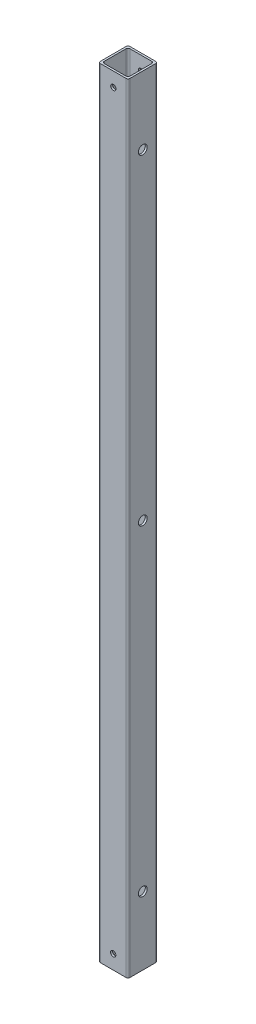
ISO-10303-21;
HEADER;
FILE_DESCRIPTION(('STEP AP214'),'2;1');
FILE_NAME('part.step','',(''),(''),'','','');
FILE_SCHEMA(('AUTOMOTIVE_DESIGN { 1 0 10303 214 1 1 1 1 }'));
ENDSEC;
DATA;
#1=APPLICATION_CONTEXT('core data for automotive mechanical design processes');
#2=APPLICATION_PROTOCOL_DEFINITION('international standard','automotive_design',2000,#1);
#3=PRODUCT_CONTEXT('',#1,'mechanical');
#4=PRODUCT('Part','Part','',(#3));
#5=PRODUCT_RELATED_PRODUCT_CATEGORY('part','',(#4));
#6=PRODUCT_DEFINITION_FORMATION('','',#4);
#7=PRODUCT_DEFINITION_CONTEXT('part definition',#1,'design');
#8=PRODUCT_DEFINITION('design','',#6,#7);
#9=PRODUCT_DEFINITION_SHAPE('','',#8);
#10=(LENGTH_UNIT() NAMED_UNIT(*) SI_UNIT(.MILLI.,.METRE.));
#11=(NAMED_UNIT(*) PLANE_ANGLE_UNIT() SI_UNIT($,.RADIAN.));
#12=(NAMED_UNIT(*) SI_UNIT($,.STERADIAN.) SOLID_ANGLE_UNIT());
#13=UNCERTAINTY_MEASURE_WITH_UNIT(LENGTH_MEASURE(1.E-05),#10,'distance_accuracy_value','');
#14=(GEOMETRIC_REPRESENTATION_CONTEXT(3) GLOBAL_UNCERTAINTY_ASSIGNED_CONTEXT((#13)) GLOBAL_UNIT_ASSIGNED_CONTEXT((#10,
#11,#12)) REPRESENTATION_CONTEXT('',''));
#15=CARTESIAN_POINT('',(0.,0.,0.));
#16=DIRECTION('',(0.,0.,1.));
#17=DIRECTION('',(1.,0.,0.));
#18=AXIS2_PLACEMENT_3D('',#15,#16,#17);
#19=CARTESIAN_POINT('',(0.,508.,0.));
#20=DIRECTION('',(0.,-1.,0.));
#21=DIRECTION('',(0.,0.,-1.));
#22=AXIS2_PLACEMENT_3D('',#19,#20,#21);
#23=PLANE('',#22);
#24=DIRECTION('',(0.,0.,1.));
#25=VECTOR('',#24,1.);
#26=CARTESIAN_POINT('',(-9.652,508.,9.652));
#27=LINE('',#26,#25);
#28=CARTESIAN_POINT('',(-9.652,508.,-8.382));
#29=VERTEX_POINT('',#28);
#30=CARTESIAN_POINT('',(-9.652,508.,8.382));
#31=VERTEX_POINT('',#30);
#32=EDGE_CURVE('E181',#29,#31,#27,.T.);
#33=ORIENTED_EDGE('',*,*,#32,.T.);
#34=CARTESIAN_POINT('',(-8.382,508.,8.382));
#35=DIRECTION('',(0.,-1.,0.));
#36=DIRECTION('',(0.,0.,-1.));
#37=AXIS2_PLACEMENT_3D('',#34,#35,#36);
#38=CIRCLE('',#37,1.27);
#39=CARTESIAN_POINT('',(-8.382,508.,9.652));
#40=VERTEX_POINT('',#39);
#41=EDGE_CURVE('E223',#31,#40,#38,.F.);
#42=ORIENTED_EDGE('',*,*,#41,.T.);
#43=DIRECTION('',(1.,0.,0.));
#44=VECTOR('',#43,1.);
#45=CARTESIAN_POINT('',(-9.652,508.,9.652));
#46=LINE('',#45,#44);
#47=CARTESIAN_POINT('',(8.382,508.,9.652));
#48=VERTEX_POINT('',#47);
#49=EDGE_CURVE('E176',#40,#48,#46,.T.);
#50=ORIENTED_EDGE('',*,*,#49,.T.);
#51=CARTESIAN_POINT('',(8.382,508.,8.382));
#52=DIRECTION('',(0.,-1.,0.));
#53=DIRECTION('',(0.,0.,-1.));
#54=AXIS2_PLACEMENT_3D('',#51,#52,#53);
#55=CIRCLE('',#54,1.27);
#56=CARTESIAN_POINT('',(9.652,508.,8.382));
#57=VERTEX_POINT('',#56);
#58=EDGE_CURVE('E218',#48,#57,#55,.F.);
#59=ORIENTED_EDGE('',*,*,#58,.T.);
#60=DIRECTION('',(0.,0.,-1.));
#61=VECTOR('',#60,1.);
#62=CARTESIAN_POINT('',(9.652,508.,9.652));
#63=LINE('',#62,#61);
#64=CARTESIAN_POINT('',(9.652,508.,-8.382));
#65=VERTEX_POINT('',#64);
#66=EDGE_CURVE('E302',#57,#65,#63,.T.);
#67=ORIENTED_EDGE('',*,*,#66,.T.);
#68=CARTESIAN_POINT('',(8.382,508.,-8.382));
#69=DIRECTION('',(0.,-1.,0.));
#70=DIRECTION('',(0.,0.,-1.));
#71=AXIS2_PLACEMENT_3D('',#68,#69,#70);
#72=CIRCLE('',#71,1.27);
#73=CARTESIAN_POINT('',(8.382,508.,-9.652));
#74=VERTEX_POINT('',#73);
#75=EDGE_CURVE('E59',#65,#74,#72,.F.);
#76=ORIENTED_EDGE('',*,*,#75,.T.);
#77=DIRECTION('',(-1.,0.,0.));
#78=VECTOR('',#77,1.);
#79=CARTESIAN_POINT('',(-9.652,508.,-9.652));
#80=LINE('',#79,#78);
#81=CARTESIAN_POINT('',(-8.382,508.,-9.652));
#82=VERTEX_POINT('',#81);
#83=EDGE_CURVE('E304',#74,#82,#80,.T.);
#84=ORIENTED_EDGE('',*,*,#83,.T.);
#85=CARTESIAN_POINT('',(-8.382,508.,-8.382));
#86=DIRECTION('',(0.,-1.,0.));
#87=DIRECTION('',(0.,0.,-1.));
#88=AXIS2_PLACEMENT_3D('',#85,#86,#87);
#89=CIRCLE('',#88,1.27);
#90=EDGE_CURVE('E221',#82,#29,#89,.F.);
#91=ORIENTED_EDGE('',*,*,#90,.T.);
#92=EDGE_LOOP('',(#33,#42,#50,#59,#67,#76,#84,#91));
#93=FACE_BOUND('',#92,.T.);
#94=DIRECTION('',(1.,0.,0.));
#95=VECTOR('',#94,1.);
#96=CARTESIAN_POINT('',(-8.382,508.,8.382));
#97=LINE('',#96,#95);
#98=CARTESIAN_POINT('',(-7.112,508.,8.382));
#99=VERTEX_POINT('',#98);
#100=CARTESIAN_POINT('',(7.112,508.,8.382));
#101=VERTEX_POINT('',#100);
#102=EDGE_CURVE('E285',#99,#101,#97,.T.);
#103=ORIENTED_EDGE('',*,*,#102,.F.);
#104=CARTESIAN_POINT('',(-7.112,508.,7.112));
#105=DIRECTION('',(0.,-1.,0.));
#106=DIRECTION('',(0.,0.,-1.));
#107=AXIS2_PLACEMENT_3D('',#104,#105,#106);
#108=CIRCLE('',#107,1.27);
#109=CARTESIAN_POINT('',(-8.382,508.,7.112));
#110=VERTEX_POINT('',#109);
#111=EDGE_CURVE('E11',#99,#110,#108,.T.);
#112=ORIENTED_EDGE('',*,*,#111,.T.);
#113=DIRECTION('',(0.,0.,1.));
#114=VECTOR('',#113,1.);
#115=CARTESIAN_POINT('',(-8.382,508.,8.382));
#116=LINE('',#115,#114);
#117=CARTESIAN_POINT('',(-8.382,508.,-7.11199999999999));
#118=VERTEX_POINT('',#117);
#119=EDGE_CURVE('E293',#118,#110,#116,.T.);
#120=ORIENTED_EDGE('',*,*,#119,.F.);
#121=CARTESIAN_POINT('',(-7.112,508.,-7.112));
#122=DIRECTION('',(0.,-1.,0.));
#123=DIRECTION('',(0.,0.,-1.));
#124=AXIS2_PLACEMENT_3D('',#121,#122,#123);
#125=CIRCLE('',#124,1.27);
#126=CARTESIAN_POINT('',(-7.112,508.,-8.382));
#127=VERTEX_POINT('',#126);
#128=EDGE_CURVE('E236',#118,#127,#125,.T.);
#129=ORIENTED_EDGE('',*,*,#128,.T.);
#130=DIRECTION('',(-1.,0.,0.));
#131=VECTOR('',#130,1.);
#132=CARTESIAN_POINT('',(-8.382,508.,-8.382));
#133=LINE('',#132,#131);
#134=CARTESIAN_POINT('',(7.112,508.,-8.382));
#135=VERTEX_POINT('',#134);
#136=EDGE_CURVE('E291',#135,#127,#133,.T.);
#137=ORIENTED_EDGE('',*,*,#136,.F.);
#138=CARTESIAN_POINT('',(7.112,508.,-7.112));
#139=DIRECTION('',(0.,-1.,0.));
#140=DIRECTION('',(0.,0.,-1.));
#141=AXIS2_PLACEMENT_3D('',#138,#139,#140);
#142=CIRCLE('',#141,1.27);
#143=CARTESIAN_POINT('',(8.382,508.,-7.11199999999999));
#144=VERTEX_POINT('',#143);
#145=EDGE_CURVE('E161',#135,#144,#142,.T.);
#146=ORIENTED_EDGE('',*,*,#145,.T.);
#147=DIRECTION('',(0.,0.,-1.));
#148=VECTOR('',#147,1.);
#149=CARTESIAN_POINT('',(8.382,508.,8.382));
#150=LINE('',#149,#148);
#151=CARTESIAN_POINT('',(8.382,508.,7.112));
#152=VERTEX_POINT('',#151);
#153=EDGE_CURVE('E288',#152,#144,#150,.T.);
#154=ORIENTED_EDGE('',*,*,#153,.F.);
#155=CARTESIAN_POINT('',(7.112,508.,7.112));
#156=DIRECTION('',(0.,-1.,0.));
#157=DIRECTION('',(0.,0.,-1.));
#158=AXIS2_PLACEMENT_3D('',#155,#156,#157);
#159=CIRCLE('',#158,1.27);
#160=EDGE_CURVE('E162',#152,#101,#159,.T.);
#161=ORIENTED_EDGE('',*,*,#160,.T.);
#162=EDGE_LOOP('',(#103,#112,#120,#129,#137,#146,#154,#161));
#163=FACE_BOUND('',#162,.T.);
#164=ADVANCED_FACE('F35',(#93,#163),#23,.F.);
#165=CARTESIAN_POINT('',(0.,0.,0.));
#166=DIRECTION('',(0.,-1.,0.));
#167=DIRECTION('',(0.,0.,-1.));
#168=AXIS2_PLACEMENT_3D('',#165,#166,#167);
#169=PLANE('',#168);
#170=DIRECTION('',(1.,0.,0.));
#171=VECTOR('',#170,1.);
#172=CARTESIAN_POINT('',(-9.652,0.,9.652));
#173=LINE('',#172,#171);
#174=CARTESIAN_POINT('',(-8.382,0.,9.652));
#175=VERTEX_POINT('',#174);
#176=CARTESIAN_POINT('',(8.382,0.,9.652));
#177=VERTEX_POINT('',#176);
#178=EDGE_CURVE('E184',#175,#177,#173,.T.);
#179=ORIENTED_EDGE('',*,*,#178,.F.);
#180=CARTESIAN_POINT('',(-8.382,0.,8.382));
#181=DIRECTION('',(0.,-1.,0.));
#182=DIRECTION('',(0.,0.,-1.));
#183=AXIS2_PLACEMENT_3D('',#180,#181,#182);
#184=CIRCLE('',#183,1.27);
#185=CARTESIAN_POINT('',(-9.652,0.,8.382));
#186=VERTEX_POINT('',#185);
#187=EDGE_CURVE('E211',#175,#186,#184,.T.);
#188=ORIENTED_EDGE('',*,*,#187,.T.);
#189=DIRECTION('',(0.,0.,1.));
#190=VECTOR('',#189,1.);
#191=CARTESIAN_POINT('',(-9.652,0.,9.652));
#192=LINE('',#191,#190);
#193=CARTESIAN_POINT('',(-9.652,0.,-8.382));
#194=VERTEX_POINT('',#193);
#195=EDGE_CURVE('E311',#194,#186,#192,.T.);
#196=ORIENTED_EDGE('',*,*,#195,.F.);
#197=CARTESIAN_POINT('',(-8.382,0.,-8.382));
#198=DIRECTION('',(0.,-1.,0.));
#199=DIRECTION('',(0.,0.,-1.));
#200=AXIS2_PLACEMENT_3D('',#197,#198,#199);
#201=CIRCLE('',#200,1.27);
#202=CARTESIAN_POINT('',(-8.382,0.,-9.652));
#203=VERTEX_POINT('',#202);
#204=EDGE_CURVE('E209',#194,#203,#201,.T.);
#205=ORIENTED_EDGE('',*,*,#204,.T.);
#206=DIRECTION('',(-1.,0.,0.));
#207=VECTOR('',#206,1.);
#208=CARTESIAN_POINT('',(-9.652,0.,-9.652));
#209=LINE('',#208,#207);
#210=CARTESIAN_POINT('',(8.382,0.,-9.652));
#211=VERTEX_POINT('',#210);
#212=EDGE_CURVE('E310',#211,#203,#209,.T.);
#213=ORIENTED_EDGE('',*,*,#212,.F.);
#214=CARTESIAN_POINT('',(8.382,0.,-8.382));
#215=DIRECTION('',(0.,-1.,0.));
#216=DIRECTION('',(0.,0.,-1.));
#217=AXIS2_PLACEMENT_3D('',#214,#215,#216);
#218=CIRCLE('',#217,1.27);
#219=CARTESIAN_POINT('',(9.652,0.,-8.382));
#220=VERTEX_POINT('',#219);
#221=EDGE_CURVE('E207',#211,#220,#218,.T.);
#222=ORIENTED_EDGE('',*,*,#221,.T.);
#223=DIRECTION('',(0.,0.,-1.));
#224=VECTOR('',#223,1.);
#225=CARTESIAN_POINT('',(9.652,0.,9.652));
#226=LINE('',#225,#224);
#227=CARTESIAN_POINT('',(9.652,0.,8.382));
#228=VERTEX_POINT('',#227);
#229=EDGE_CURVE('E296',#228,#220,#226,.T.);
#230=ORIENTED_EDGE('',*,*,#229,.F.);
#231=CARTESIAN_POINT('',(8.382,0.,8.382));
#232=DIRECTION('',(0.,-1.,0.));
#233=DIRECTION('',(0.,0.,-1.));
#234=AXIS2_PLACEMENT_3D('',#231,#232,#233);
#235=CIRCLE('',#234,1.27);
#236=EDGE_CURVE('E205',#228,#177,#235,.T.);
#237=ORIENTED_EDGE('',*,*,#236,.T.);
#238=EDGE_LOOP('',(#179,#188,#196,#205,#213,#222,#230,#237));
#239=FACE_BOUND('',#238,.T.);
#240=DIRECTION('',(-1.,0.,0.));
#241=VECTOR('',#240,1.);
#242=CARTESIAN_POINT('',(-8.382,0.,-8.382));
#243=LINE('',#242,#241);
#244=CARTESIAN_POINT('',(7.112,0.,-8.382));
#245=VERTEX_POINT('',#244);
#246=CARTESIAN_POINT('',(-7.112,0.,-8.382));
#247=VERTEX_POINT('',#246);
#248=EDGE_CURVE('E154',#245,#247,#243,.T.);
#249=ORIENTED_EDGE('',*,*,#248,.T.);
#250=CARTESIAN_POINT('',(-7.112,0.,-7.112));
#251=DIRECTION('',(0.,-1.,0.));
#252=DIRECTION('',(0.,0.,-1.));
#253=AXIS2_PLACEMENT_3D('',#250,#251,#252);
#254=CIRCLE('',#253,1.27);
#255=CARTESIAN_POINT('',(-8.382,0.,-7.11199999999999));
#256=VERTEX_POINT('',#255);
#257=EDGE_CURVE('E234',#247,#256,#254,.F.);
#258=ORIENTED_EDGE('',*,*,#257,.T.);
#259=DIRECTION('',(0.,0.,1.));
#260=VECTOR('',#259,1.);
#261=CARTESIAN_POINT('',(-8.382,0.,8.382));
#262=LINE('',#261,#260);
#263=CARTESIAN_POINT('',(-8.382,0.,7.112));
#264=VERTEX_POINT('',#263);
#265=EDGE_CURVE('E172',#256,#264,#262,.T.);
#266=ORIENTED_EDGE('',*,*,#265,.T.);
#267=CARTESIAN_POINT('',(-7.112,0.,7.112));
#268=DIRECTION('',(0.,-1.,0.));
#269=DIRECTION('',(0.,0.,-1.));
#270=AXIS2_PLACEMENT_3D('',#267,#268,#269);
#271=CIRCLE('',#270,1.27);
#272=CARTESIAN_POINT('',(-7.112,0.,8.382));
#273=VERTEX_POINT('',#272);
#274=EDGE_CURVE('E44',#264,#273,#271,.F.);
#275=ORIENTED_EDGE('',*,*,#274,.T.);
#276=DIRECTION('',(1.,0.,0.));
#277=VECTOR('',#276,1.);
#278=CARTESIAN_POINT('',(-8.382,0.,8.382));
#279=LINE('',#278,#277);
#280=CARTESIAN_POINT('',(7.112,0.,8.382));
#281=VERTEX_POINT('',#280);
#282=EDGE_CURVE('E284',#273,#281,#279,.T.);
#283=ORIENTED_EDGE('',*,*,#282,.T.);
#284=CARTESIAN_POINT('',(7.112,0.,7.112));
#285=DIRECTION('',(0.,-1.,0.));
#286=DIRECTION('',(0.,0.,-1.));
#287=AXIS2_PLACEMENT_3D('',#284,#285,#286);
#288=CIRCLE('',#287,1.27);
#289=CARTESIAN_POINT('',(8.382,0.,7.112));
#290=VERTEX_POINT('',#289);
#291=EDGE_CURVE('E238',#281,#290,#288,.F.);
#292=ORIENTED_EDGE('',*,*,#291,.T.);
#293=DIRECTION('',(0.,0.,-1.));
#294=VECTOR('',#293,1.);
#295=CARTESIAN_POINT('',(8.382,0.,8.382));
#296=LINE('',#295,#294);
#297=CARTESIAN_POINT('',(8.382,0.,-7.11199999999999));
#298=VERTEX_POINT('',#297);
#299=EDGE_CURVE('E156',#290,#298,#296,.T.);
#300=ORIENTED_EDGE('',*,*,#299,.T.);
#301=CARTESIAN_POINT('',(7.112,0.,-7.112));
#302=DIRECTION('',(0.,-1.,0.));
#303=DIRECTION('',(0.,0.,-1.));
#304=AXIS2_PLACEMENT_3D('',#301,#302,#303);
#305=CIRCLE('',#304,1.27);
#306=EDGE_CURVE('E151',#298,#245,#305,.F.);
#307=ORIENTED_EDGE('',*,*,#306,.T.);
#308=EDGE_LOOP('',(#249,#258,#266,#275,#283,#292,#300,#307));
#309=FACE_BOUND('',#308,.T.);
#310=ADVANCED_FACE('F153',(#239,#309),#169,.T.);
#311=CARTESIAN_POINT('',(9.652,508.,9.652));
#312=DIRECTION('',(-1.,0.,0.));
#313=DIRECTION('',(0.,0.,1.));
#314=AXIS2_PLACEMENT_3D('',#311,#312,#313);
#315=PLANE('',#314);
#316=CARTESIAN_POINT('',(9.652,44.45,0.));
#317=DIRECTION('',(-1.,0.,0.));
#318=DIRECTION('',(0.,0.,1.));
#319=AXIS2_PLACEMENT_3D('',#316,#317,#318);
#320=CIRCLE('',#319,2.8956);
#321=CARTESIAN_POINT('',(9.652,44.45,2.8956));
#322=VERTEX_POINT('',#321);
#323=EDGE_CURVE('E255',#322,#322,#320,.T.);
#324=ORIENTED_EDGE('',*,*,#323,.T.);
#325=EDGE_LOOP('',(#324));
#326=FACE_BOUND('',#325,.T.);
#327=CARTESIAN_POINT('',(9.652,254.,0.));
#328=DIRECTION('',(-1.,0.,0.));
#329=DIRECTION('',(0.,0.,1.));
#330=AXIS2_PLACEMENT_3D('',#327,#328,#329);
#331=CIRCLE('',#330,2.8956);
#332=CARTESIAN_POINT('',(9.652,254.,2.8956));
#333=VERTEX_POINT('',#332);
#334=EDGE_CURVE('E251',#333,#333,#331,.T.);
#335=ORIENTED_EDGE('',*,*,#334,.T.);
#336=EDGE_LOOP('',(#335));
#337=FACE_BOUND('',#336,.T.);
#338=CARTESIAN_POINT('',(9.652,463.55,0.));
#339=DIRECTION('',(-1.,0.,0.));
#340=DIRECTION('',(0.,0.,1.));
#341=AXIS2_PLACEMENT_3D('',#338,#339,#340);
#342=CIRCLE('',#341,2.8956);
#343=CARTESIAN_POINT('',(9.652,463.55,2.8956));
#344=VERTEX_POINT('',#343);
#345=EDGE_CURVE('E247',#344,#344,#342,.T.);
#346=ORIENTED_EDGE('',*,*,#345,.T.);
#347=EDGE_LOOP('',(#346));
#348=FACE_BOUND('',#347,.T.);
#349=ORIENTED_EDGE('',*,*,#229,.T.);
#350=DIRECTION('',(0.,-1.,0.));
#351=VECTOR('',#350,1.);
#352=CARTESIAN_POINT('',(9.652,508.,-8.382));
#353=LINE('',#352,#351);
#354=EDGE_CURVE('E232',#220,#65,#353,.F.);
#355=ORIENTED_EDGE('',*,*,#354,.T.);
#356=ORIENTED_EDGE('',*,*,#66,.F.);
#357=DIRECTION('',(0.,-1.,0.));
#358=VECTOR('',#357,1.);
#359=CARTESIAN_POINT('',(9.652,508.,8.382));
#360=LINE('',#359,#358);
#361=EDGE_CURVE('E229',#57,#228,#360,.T.);
#362=ORIENTED_EDGE('',*,*,#361,.T.);
#363=EDGE_LOOP('',(#349,#355,#356,#362));
#364=FACE_BOUND('',#363,.T.);
#365=ADVANCED_FACE('F330',(#326,#337,#348,#364),#315,.F.);
#366=CARTESIAN_POINT('',(-9.652,508.,-9.652));
#367=DIRECTION('',(0.,0.,1.));
#368=DIRECTION('',(1.,0.,0.));
#369=AXIS2_PLACEMENT_3D('',#366,#367,#368);
#370=PLANE('',#369);
#371=CARTESIAN_POINT('',(0.,9.271,-9.652));
#372=DIRECTION('',(0.,0.,1.));
#373=DIRECTION('',(1.,0.,0.));
#374=AXIS2_PLACEMENT_3D('',#371,#372,#373);
#375=CIRCLE('',#374,1.7272);
#376=CARTESIAN_POINT('',(1.72720000000006,9.271,-9.652));
#377=VERTEX_POINT('',#376);
#378=EDGE_CURVE('E673',#377,#377,#375,.T.);
#379=ORIENTED_EDGE('',*,*,#378,.T.);
#380=EDGE_LOOP('',(#379));
#381=FACE_BOUND('',#380,.T.);
#382=CARTESIAN_POINT('',(0.103095801553498,498.728999999999,-9.652));
#383=DIRECTION('',(0.,0.,1.));
#384=DIRECTION('',(1.,0.,0.));
#385=AXIS2_PLACEMENT_3D('',#382,#383,#384);
#386=CIRCLE('',#385,1.7272);
#387=CARTESIAN_POINT('',(1.83029580155349,498.728999999999,-9.652));
#388=VERTEX_POINT('',#387);
#389=EDGE_CURVE('E660',#388,#388,#386,.T.);
#390=ORIENTED_EDGE('',*,*,#389,.T.);
#391=EDGE_LOOP('',(#390));
#392=FACE_BOUND('',#391,.T.);
#393=ORIENTED_EDGE('',*,*,#212,.T.);
#394=DIRECTION('',(0.,-1.,0.));
#395=VECTOR('',#394,1.);
#396=CARTESIAN_POINT('',(-8.382,508.,-9.652));
#397=LINE('',#396,#395);
#398=EDGE_CURVE('E52',#203,#82,#397,.F.);
#399=ORIENTED_EDGE('',*,*,#398,.T.);
#400=ORIENTED_EDGE('',*,*,#83,.F.);
#401=DIRECTION('',(0.,-1.,0.));
#402=VECTOR('',#401,1.);
#403=CARTESIAN_POINT('',(8.382,508.,-9.652));
#404=LINE('',#403,#402);
#405=EDGE_CURVE('E225',#74,#211,#404,.T.);
#406=ORIENTED_EDGE('',*,*,#405,.T.);
#407=EDGE_LOOP('',(#393,#399,#400,#406));
#408=FACE_BOUND('',#407,.T.);
#409=ADVANCED_FACE('F337',(#381,#392,#408),#370,.F.);
#410=CARTESIAN_POINT('',(-9.652,508.,9.652));
#411=DIRECTION('',(1.,0.,0.));
#412=DIRECTION('',(0.,0.,-1.));
#413=AXIS2_PLACEMENT_3D('',#410,#411,#412);
#414=PLANE('',#413);
#415=CARTESIAN_POINT('',(-9.652,44.45,0.));
#416=DIRECTION('',(-1.,0.,0.));
#417=DIRECTION('',(0.,0.,1.));
#418=AXIS2_PLACEMENT_3D('',#415,#416,#417);
#419=CIRCLE('',#418,2.89559999999998);
#420=CARTESIAN_POINT('',(-9.652,44.45,2.89559999999998));
#421=VERTEX_POINT('',#420);
#422=EDGE_CURVE('E262',#421,#421,#419,.T.);
#423=ORIENTED_EDGE('',*,*,#422,.F.);
#424=EDGE_LOOP('',(#423));
#425=FACE_BOUND('',#424,.T.);
#426=CARTESIAN_POINT('',(-9.652,254.,0.));
#427=DIRECTION('',(-1.,0.,0.));
#428=DIRECTION('',(0.,0.,1.));
#429=AXIS2_PLACEMENT_3D('',#426,#427,#428);
#430=CIRCLE('',#429,2.8956);
#431=CARTESIAN_POINT('',(-9.652,254.,2.8956));
#432=VERTEX_POINT('',#431);
#433=EDGE_CURVE('E259',#432,#432,#430,.T.);
#434=ORIENTED_EDGE('',*,*,#433,.F.);
#435=EDGE_LOOP('',(#434));
#436=FACE_BOUND('',#435,.T.);
#437=CARTESIAN_POINT('',(-9.652,463.55,0.));
#438=DIRECTION('',(-1.,0.,0.));
#439=DIRECTION('',(0.,0.,1.));
#440=AXIS2_PLACEMENT_3D('',#437,#438,#439);
#441=CIRCLE('',#440,2.8956);
#442=CARTESIAN_POINT('',(-9.652,463.55,2.8956));
#443=VERTEX_POINT('',#442);
#444=EDGE_CURVE('E277',#443,#443,#441,.T.);
#445=ORIENTED_EDGE('',*,*,#444,.F.);
#446=EDGE_LOOP('',(#445));
#447=FACE_BOUND('',#446,.T.);
#448=ORIENTED_EDGE('',*,*,#195,.T.);
#449=DIRECTION('',(0.,-1.,0.));
#450=VECTOR('',#449,1.);
#451=CARTESIAN_POINT('',(-9.652,508.,8.382));
#452=LINE('',#451,#450);
#453=EDGE_CURVE('E216',#186,#31,#452,.F.);
#454=ORIENTED_EDGE('',*,*,#453,.T.);
#455=ORIENTED_EDGE('',*,*,#32,.F.);
#456=DIRECTION('',(0.,-1.,0.));
#457=VECTOR('',#456,1.);
#458=CARTESIAN_POINT('',(-9.652,508.,-8.382));
#459=LINE('',#458,#457);
#460=EDGE_CURVE('E213',#29,#194,#459,.T.);
#461=ORIENTED_EDGE('',*,*,#460,.T.);
#462=EDGE_LOOP('',(#448,#454,#455,#461));
#463=FACE_BOUND('',#462,.T.);
#464=ADVANCED_FACE('F343',(#425,#436,#447,#463),#414,.F.);
#465=CARTESIAN_POINT('',(-9.652,508.,9.652));
#466=DIRECTION('',(0.,0.,-1.));
#467=DIRECTION('',(-1.,0.,0.));
#468=AXIS2_PLACEMENT_3D('',#465,#466,#467);
#469=PLANE('',#468);
#470=CARTESIAN_POINT('',(0.,9.271,9.652));
#471=DIRECTION('',(0.,0.,1.));
#472=DIRECTION('',(1.,0.,0.));
#473=AXIS2_PLACEMENT_3D('',#470,#471,#472);
#474=CIRCLE('',#473,1.7272);
#475=CARTESIAN_POINT('',(1.72720000000006,9.271,9.652));
#476=VERTEX_POINT('',#475);
#477=EDGE_CURVE('E676',#476,#476,#474,.T.);
#478=ORIENTED_EDGE('',*,*,#477,.F.);
#479=EDGE_LOOP('',(#478));
#480=FACE_BOUND('',#479,.T.);
#481=CARTESIAN_POINT('',(0.103095801553498,498.728999999999,9.652));
#482=DIRECTION('',(0.,0.,1.));
#483=DIRECTION('',(1.,0.,0.));
#484=AXIS2_PLACEMENT_3D('',#481,#482,#483);
#485=CIRCLE('',#484,1.7272);
#486=CARTESIAN_POINT('',(1.8302958015535,498.728999999999,9.652));
#487=VERTEX_POINT('',#486);
#488=EDGE_CURVE('E663',#487,#487,#485,.T.);
#489=ORIENTED_EDGE('',*,*,#488,.F.);
#490=EDGE_LOOP('',(#489));
#491=FACE_BOUND('',#490,.T.);
#492=ORIENTED_EDGE('',*,*,#49,.F.);
#493=DIRECTION('',(0.,-1.,0.));
#494=VECTOR('',#493,1.);
#495=CARTESIAN_POINT('',(-8.382,508.,9.652));
#496=LINE('',#495,#494);
#497=EDGE_CURVE('E202',#40,#175,#496,.T.);
#498=ORIENTED_EDGE('',*,*,#497,.T.);
#499=ORIENTED_EDGE('',*,*,#178,.T.);
#500=DIRECTION('',(0.,-1.,0.));
#501=VECTOR('',#500,1.);
#502=CARTESIAN_POINT('',(8.382,508.,9.652));
#503=LINE('',#502,#501);
#504=EDGE_CURVE('E200',#177,#48,#503,.F.);
#505=ORIENTED_EDGE('',*,*,#504,.T.);
#506=EDGE_LOOP('',(#492,#498,#499,#505));
#507=FACE_BOUND('',#506,.T.);
#508=ADVANCED_FACE('F321',(#480,#491,#507),#469,.F.);
#509=CARTESIAN_POINT('',(-8.382,508.,8.382));
#510=DIRECTION('',(0.,0.,-1.));
#511=DIRECTION('',(-1.,0.,0.));
#512=AXIS2_PLACEMENT_3D('',#509,#510,#511);
#513=PLANE('',#512);
#514=CARTESIAN_POINT('',(0.,9.271,8.382));
#515=DIRECTION('',(0.,0.,-1.));
#516=DIRECTION('',(-1.,0.,0.));
#517=AXIS2_PLACEMENT_3D('',#514,#515,#516);
#518=CIRCLE('',#517,1.7272);
#519=CARTESIAN_POINT('',(-1.72719999999993,9.271,8.382));
#520=VERTEX_POINT('',#519);
#521=EDGE_CURVE('E39',#520,#520,#518,.T.);
#522=ORIENTED_EDGE('',*,*,#521,.F.);
#523=EDGE_LOOP('',(#522));
#524=FACE_BOUND('',#523,.T.);
#525=CARTESIAN_POINT('',(0.103095801553498,498.728999999999,8.382));
#526=DIRECTION('',(0.,0.,-1.));
#527=DIRECTION('',(-1.,0.,0.));
#528=AXIS2_PLACEMENT_3D('',#525,#526,#527);
#529=CIRCLE('',#528,1.7272);
#530=CARTESIAN_POINT('',(-1.6241041984465,498.728999999999,8.382));
#531=VERTEX_POINT('',#530);
#532=EDGE_CURVE('E662',#531,#531,#529,.T.);
#533=ORIENTED_EDGE('',*,*,#532,.F.);
#534=EDGE_LOOP('',(#533));
#535=FACE_BOUND('',#534,.T.);
#536=ORIENTED_EDGE('',*,*,#102,.T.);
#537=DIRECTION('',(0.,-1.,0.));
#538=VECTOR('',#537,1.);
#539=CARTESIAN_POINT('',(7.112,0.,8.382));
#540=LINE('',#539,#538);
#541=EDGE_CURVE('E193',#101,#281,#540,.T.);
#542=ORIENTED_EDGE('',*,*,#541,.T.);
#543=ORIENTED_EDGE('',*,*,#282,.F.);
#544=DIRECTION('',(0.,-1.,0.));
#545=VECTOR('',#544,1.);
#546=CARTESIAN_POINT('',(-7.112,508.,8.382));
#547=LINE('',#546,#545);
#548=EDGE_CURVE('E191',#273,#99,#547,.F.);
#549=ORIENTED_EDGE('',*,*,#548,.T.);
#550=EDGE_LOOP('',(#536,#542,#543,#549));
#551=FACE_BOUND('',#550,.T.);
#552=ADVANCED_FACE('F364',(#524,#535,#551),#513,.T.);
#553=CARTESIAN_POINT('',(8.382,508.,8.382));
#554=DIRECTION('',(-1.,0.,0.));
#555=DIRECTION('',(0.,0.,1.));
#556=AXIS2_PLACEMENT_3D('',#553,#554,#555);
#557=PLANE('',#556);
#558=CARTESIAN_POINT('',(8.382,44.45,0.));
#559=DIRECTION('',(-1.,0.,0.));
#560=DIRECTION('',(0.,0.,1.));
#561=AXIS2_PLACEMENT_3D('',#558,#559,#560);
#562=CIRCLE('',#561,2.89559999999999);
#563=CARTESIAN_POINT('',(8.382,44.45,2.89559999999999));
#564=VERTEX_POINT('',#563);
#565=EDGE_CURVE('E254',#564,#564,#562,.T.);
#566=ORIENTED_EDGE('',*,*,#565,.F.);
#567=EDGE_LOOP('',(#566));
#568=FACE_BOUND('',#567,.T.);
#569=CARTESIAN_POINT('',(8.382,254.,0.));
#570=DIRECTION('',(-1.,0.,0.));
#571=DIRECTION('',(0.,0.,1.));
#572=AXIS2_PLACEMENT_3D('',#569,#570,#571);
#573=CIRCLE('',#572,2.8956);
#574=CARTESIAN_POINT('',(8.382,254.,2.8956));
#575=VERTEX_POINT('',#574);
#576=EDGE_CURVE('E250',#575,#575,#573,.T.);
#577=ORIENTED_EDGE('',*,*,#576,.F.);
#578=EDGE_LOOP('',(#577));
#579=FACE_BOUND('',#578,.T.);
#580=CARTESIAN_POINT('',(8.382,463.55,0.));
#581=DIRECTION('',(-1.,0.,0.));
#582=DIRECTION('',(0.,0.,1.));
#583=AXIS2_PLACEMENT_3D('',#580,#581,#582);
#584=CIRCLE('',#583,2.8956);
#585=CARTESIAN_POINT('',(8.382,463.55,2.8956));
#586=VERTEX_POINT('',#585);
#587=EDGE_CURVE('E246',#586,#586,#584,.T.);
#588=ORIENTED_EDGE('',*,*,#587,.F.);
#589=EDGE_LOOP('',(#588));
#590=FACE_BOUND('',#589,.T.);
#591=ORIENTED_EDGE('',*,*,#299,.F.);
#592=DIRECTION('',(0.,-1.,0.));
#593=VECTOR('',#592,1.);
#594=CARTESIAN_POINT('',(8.382,508.,7.112));
#595=LINE('',#594,#593);
#596=EDGE_CURVE('E198',#290,#152,#595,.F.);
#597=ORIENTED_EDGE('',*,*,#596,.T.);
#598=ORIENTED_EDGE('',*,*,#153,.T.);
#599=DIRECTION('',(0.,-1.,0.));
#600=VECTOR('',#599,1.);
#601=CARTESIAN_POINT('',(8.382,0.,-7.112));
#602=LINE('',#601,#600);
#603=EDGE_CURVE('E196',#144,#298,#602,.T.);
#604=ORIENTED_EDGE('',*,*,#603,.T.);
#605=EDGE_LOOP('',(#591,#597,#598,#604));
#606=FACE_BOUND('',#605,.T.);
#607=ADVANCED_FACE('F451',(#568,#579,#590,#606),#557,.T.);
#608=CARTESIAN_POINT('',(-8.382,508.,-8.382));
#609=DIRECTION('',(0.,0.,1.));
#610=DIRECTION('',(1.,0.,0.));
#611=AXIS2_PLACEMENT_3D('',#608,#609,#610);
#612=PLANE('',#611);
#613=CARTESIAN_POINT('',(0.,9.271,-8.382));
#614=DIRECTION('',(0.,0.,1.));
#615=DIRECTION('',(1.,0.,0.));
#616=AXIS2_PLACEMENT_3D('',#613,#614,#615);
#617=CIRCLE('',#616,1.7272);
#618=CARTESIAN_POINT('',(1.72720000000006,9.271,-8.382));
#619=VERTEX_POINT('',#618);
#620=EDGE_CURVE('E668',#619,#619,#617,.T.);
#621=ORIENTED_EDGE('',*,*,#620,.F.);
#622=EDGE_LOOP('',(#621));
#623=FACE_BOUND('',#622,.T.);
#624=CARTESIAN_POINT('',(0.103095801553498,498.728999999999,-8.382));
#625=DIRECTION('',(0.,0.,1.));
#626=DIRECTION('',(1.,0.,0.));
#627=AXIS2_PLACEMENT_3D('',#624,#625,#626);
#628=CIRCLE('',#627,1.7272);
#629=CARTESIAN_POINT('',(1.83029580155349,498.728999999999,-8.382));
#630=VERTEX_POINT('',#629);
#631=EDGE_CURVE('E267',#630,#630,#628,.T.);
#632=ORIENTED_EDGE('',*,*,#631,.F.);
#633=EDGE_LOOP('',(#632));
#634=FACE_BOUND('',#633,.T.);
#635=ORIENTED_EDGE('',*,*,#136,.T.);
#636=DIRECTION('',(0.,-1.,0.));
#637=VECTOR('',#636,1.);
#638=CARTESIAN_POINT('',(-7.112,0.,-8.382));
#639=LINE('',#638,#637);
#640=EDGE_CURVE('E171',#127,#247,#639,.T.);
#641=ORIENTED_EDGE('',*,*,#640,.T.);
#642=ORIENTED_EDGE('',*,*,#248,.F.);
#643=DIRECTION('',(0.,-1.,0.));
#644=VECTOR('',#643,1.);
#645=CARTESIAN_POINT('',(7.112,508.,-8.382));
#646=LINE('',#645,#644);
#647=EDGE_CURVE('E168',#245,#135,#646,.F.);
#648=ORIENTED_EDGE('',*,*,#647,.T.);
#649=EDGE_LOOP('',(#635,#641,#642,#648));
#650=FACE_BOUND('',#649,.T.);
#651=ADVANCED_FACE('F167',(#623,#634,#650),#612,.T.);
#652=CARTESIAN_POINT('',(-8.382,508.,8.382));
#653=DIRECTION('',(1.,0.,0.));
#654=DIRECTION('',(0.,0.,-1.));
#655=AXIS2_PLACEMENT_3D('',#652,#653,#654);
#656=PLANE('',#655);
#657=CARTESIAN_POINT('',(-8.382,44.45,0.));
#658=DIRECTION('',(1.,0.,0.));
#659=DIRECTION('',(0.,0.,-1.));
#660=AXIS2_PLACEMENT_3D('',#657,#658,#659);
#661=CIRCLE('',#660,2.89559999999999);
#662=CARTESIAN_POINT('',(-8.382,44.45,-2.89559999999999));
#663=VERTEX_POINT('',#662);
#664=EDGE_CURVE('E252',#663,#663,#661,.T.);
#665=ORIENTED_EDGE('',*,*,#664,.F.);
#666=EDGE_LOOP('',(#665));
#667=FACE_BOUND('',#666,.T.);
#668=CARTESIAN_POINT('',(-8.382,254.,0.));
#669=DIRECTION('',(1.,0.,0.));
#670=DIRECTION('',(0.,0.,-1.));
#671=AXIS2_PLACEMENT_3D('',#668,#669,#670);
#672=CIRCLE('',#671,2.8956);
#673=CARTESIAN_POINT('',(-8.382,254.,-2.8956));
#674=VERTEX_POINT('',#673);
#675=EDGE_CURVE('E248',#674,#674,#672,.T.);
#676=ORIENTED_EDGE('',*,*,#675,.F.);
#677=EDGE_LOOP('',(#676));
#678=FACE_BOUND('',#677,.T.);
#679=CARTESIAN_POINT('',(-8.382,463.55,0.));
#680=DIRECTION('',(1.,0.,0.));
#681=DIRECTION('',(0.,0.,-1.));
#682=AXIS2_PLACEMENT_3D('',#679,#680,#681);
#683=CIRCLE('',#682,2.8956);
#684=CARTESIAN_POINT('',(-8.382,463.55,-2.8956));
#685=VERTEX_POINT('',#684);
#686=EDGE_CURVE('E243',#685,#685,#683,.T.);
#687=ORIENTED_EDGE('',*,*,#686,.F.);
#688=EDGE_LOOP('',(#687));
#689=FACE_BOUND('',#688,.T.);
#690=ORIENTED_EDGE('',*,*,#265,.F.);
#691=DIRECTION('',(0.,-1.,0.));
#692=VECTOR('',#691,1.);
#693=CARTESIAN_POINT('',(-8.382,508.,-7.112));
#694=LINE('',#693,#692);
#695=EDGE_CURVE('E189',#256,#118,#694,.F.);
#696=ORIENTED_EDGE('',*,*,#695,.T.);
#697=ORIENTED_EDGE('',*,*,#119,.T.);
#698=DIRECTION('',(0.,-1.,0.));
#699=VECTOR('',#698,1.);
#700=CARTESIAN_POINT('',(-8.382,0.,7.112));
#701=LINE('',#700,#699);
#702=EDGE_CURVE('E178',#110,#264,#701,.T.);
#703=ORIENTED_EDGE('',*,*,#702,.T.);
#704=EDGE_LOOP('',(#690,#696,#697,#703));
#705=FACE_BOUND('',#704,.T.);
#706=ADVANCED_FACE('F382',(#667,#678,#689,#705),#656,.T.);
#707=CARTESIAN_POINT('',(-7.112,508.,-7.112));
#708=DIRECTION('',(0.,1.,0.));
#709=DIRECTION('',(0.,0.,1.));
#710=AXIS2_PLACEMENT_3D('',#707,#708,#709);
#711=CYLINDRICAL_SURFACE('',#710,1.27);
#712=ORIENTED_EDGE('',*,*,#128,.F.);
#713=ORIENTED_EDGE('',*,*,#695,.F.);
#714=ORIENTED_EDGE('',*,*,#257,.F.);
#715=ORIENTED_EDGE('',*,*,#640,.F.);
#716=EDGE_LOOP('',(#712,#713,#714,#715));
#717=FACE_BOUND('',#716,.T.);
#718=ADVANCED_FACE('F378',(#717),#711,.F.);
#719=CARTESIAN_POINT('',(7.112,508.,7.112));
#720=DIRECTION('',(0.,1.,0.));
#721=DIRECTION('',(0.,0.,1.));
#722=AXIS2_PLACEMENT_3D('',#719,#720,#721);
#723=CYLINDRICAL_SURFACE('',#722,1.27);
#724=ORIENTED_EDGE('',*,*,#160,.F.);
#725=ORIENTED_EDGE('',*,*,#596,.F.);
#726=ORIENTED_EDGE('',*,*,#291,.F.);
#727=ORIENTED_EDGE('',*,*,#541,.F.);
#728=EDGE_LOOP('',(#724,#725,#726,#727));
#729=FACE_BOUND('',#728,.T.);
#730=ADVANCED_FACE('F381',(#729),#723,.F.);
#731=CARTESIAN_POINT('',(7.112,508.,-7.112));
#732=DIRECTION('',(0.,1.,0.));
#733=DIRECTION('',(0.,0.,1.));
#734=AXIS2_PLACEMENT_3D('',#731,#732,#733);
#735=CYLINDRICAL_SURFACE('',#734,1.27);
#736=ORIENTED_EDGE('',*,*,#145,.F.);
#737=ORIENTED_EDGE('',*,*,#647,.F.);
#738=ORIENTED_EDGE('',*,*,#306,.F.);
#739=ORIENTED_EDGE('',*,*,#603,.F.);
#740=EDGE_LOOP('',(#736,#737,#738,#739));
#741=FACE_BOUND('',#740,.T.);
#742=ADVANCED_FACE('F175',(#741),#735,.F.);
#743=CARTESIAN_POINT('',(-7.112,508.,7.112));
#744=DIRECTION('',(0.,1.,0.));
#745=DIRECTION('',(0.,0.,1.));
#746=AXIS2_PLACEMENT_3D('',#743,#744,#745);
#747=CYLINDRICAL_SURFACE('',#746,1.27);
#748=ORIENTED_EDGE('',*,*,#111,.F.);
#749=ORIENTED_EDGE('',*,*,#548,.F.);
#750=ORIENTED_EDGE('',*,*,#274,.F.);
#751=ORIENTED_EDGE('',*,*,#702,.F.);
#752=EDGE_LOOP('',(#748,#749,#750,#751));
#753=FACE_BOUND('',#752,.T.);
#754=ADVANCED_FACE('F348',(#753),#747,.F.);
#755=CARTESIAN_POINT('',(-8.382,508.,8.382));
#756=DIRECTION('',(0.,-1.,0.));
#757=DIRECTION('',(0.,0.,-1.));
#758=AXIS2_PLACEMENT_3D('',#755,#756,#757);
#759=CYLINDRICAL_SURFACE('',#758,1.27);
#760=ORIENTED_EDGE('',*,*,#41,.F.);
#761=ORIENTED_EDGE('',*,*,#453,.F.);
#762=ORIENTED_EDGE('',*,*,#187,.F.);
#763=ORIENTED_EDGE('',*,*,#497,.F.);
#764=EDGE_LOOP('',(#760,#761,#762,#763));
#765=FACE_BOUND('',#764,.T.);
#766=ADVANCED_FACE('F346',(#765),#759,.T.);
#767=CARTESIAN_POINT('',(-8.382,508.,-8.382));
#768=DIRECTION('',(0.,-1.,0.));
#769=DIRECTION('',(0.,0.,-1.));
#770=AXIS2_PLACEMENT_3D('',#767,#768,#769);
#771=CYLINDRICAL_SURFACE('',#770,1.27);
#772=ORIENTED_EDGE('',*,*,#90,.F.);
#773=ORIENTED_EDGE('',*,*,#398,.F.);
#774=ORIENTED_EDGE('',*,*,#204,.F.);
#775=ORIENTED_EDGE('',*,*,#460,.F.);
#776=EDGE_LOOP('',(#772,#773,#774,#775));
#777=FACE_BOUND('',#776,.T.);
#778=ADVANCED_FACE('F341',(#777),#771,.T.);
#779=CARTESIAN_POINT('',(8.382,508.,-8.382));
#780=DIRECTION('',(0.,-1.,0.));
#781=DIRECTION('',(0.,0.,-1.));
#782=AXIS2_PLACEMENT_3D('',#779,#780,#781);
#783=CYLINDRICAL_SURFACE('',#782,1.27);
#784=ORIENTED_EDGE('',*,*,#75,.F.);
#785=ORIENTED_EDGE('',*,*,#354,.F.);
#786=ORIENTED_EDGE('',*,*,#221,.F.);
#787=ORIENTED_EDGE('',*,*,#405,.F.);
#788=EDGE_LOOP('',(#784,#785,#786,#787));
#789=FACE_BOUND('',#788,.T.);
#790=ADVANCED_FACE('F334',(#789),#783,.T.);
#791=CARTESIAN_POINT('',(8.382,508.,8.382));
#792=DIRECTION('',(0.,-1.,0.));
#793=DIRECTION('',(0.,0.,-1.));
#794=AXIS2_PLACEMENT_3D('',#791,#792,#793);
#795=CYLINDRICAL_SURFACE('',#794,1.27);
#796=ORIENTED_EDGE('',*,*,#58,.F.);
#797=ORIENTED_EDGE('',*,*,#504,.F.);
#798=ORIENTED_EDGE('',*,*,#236,.F.);
#799=ORIENTED_EDGE('',*,*,#361,.F.);
#800=EDGE_LOOP('',(#796,#797,#798,#799));
#801=FACE_BOUND('',#800,.T.);
#802=ADVANCED_FACE('F37',(#801),#795,.T.);
#803=CARTESIAN_POINT('',(-9.652,463.55,0.));
#804=DIRECTION('',(-1.,0.,0.));
#805=DIRECTION('',(0.,0.,1.));
#806=AXIS2_PLACEMENT_3D('',#803,#804,#805);
#807=CYLINDRICAL_SURFACE('',#806,2.8956);
#808=ORIENTED_EDGE('',*,*,#686,.T.);
#809=EDGE_LOOP('',(#808));
#810=FACE_BOUND('',#809,.T.);
#811=ORIENTED_EDGE('',*,*,#444,.T.);
#812=EDGE_LOOP('',(#811));
#813=FACE_BOUND('',#812,.T.);
#814=ADVANCED_FACE('F422',(#810,#813),#807,.F.);
#815=ORIENTED_EDGE('',*,*,#587,.T.);
#816=EDGE_LOOP('',(#815));
#817=FACE_BOUND('',#816,.T.);
#818=ORIENTED_EDGE('',*,*,#345,.F.);
#819=EDGE_LOOP('',(#818));
#820=FACE_BOUND('',#819,.T.);
#821=ADVANCED_FACE('F462',(#817,#820),#807,.F.);
#822=CARTESIAN_POINT('',(-9.652,254.,0.));
#823=DIRECTION('',(-1.,0.,0.));
#824=DIRECTION('',(0.,0.,1.));
#825=AXIS2_PLACEMENT_3D('',#822,#823,#824);
#826=CYLINDRICAL_SURFACE('',#825,2.8956);
#827=ORIENTED_EDGE('',*,*,#675,.T.);
#828=EDGE_LOOP('',(#827));
#829=FACE_BOUND('',#828,.T.);
#830=ORIENTED_EDGE('',*,*,#433,.T.);
#831=EDGE_LOOP('',(#830));
#832=FACE_BOUND('',#831,.T.);
#833=ADVANCED_FACE('F472',(#829,#832),#826,.F.);
#834=ORIENTED_EDGE('',*,*,#576,.T.);
#835=EDGE_LOOP('',(#834));
#836=FACE_BOUND('',#835,.T.);
#837=ORIENTED_EDGE('',*,*,#334,.F.);
#838=EDGE_LOOP('',(#837));
#839=FACE_BOUND('',#838,.T.);
#840=ADVANCED_FACE('F481',(#836,#839),#826,.F.);
#841=CARTESIAN_POINT('',(-9.652,44.45,0.));
#842=DIRECTION('',(-1.,0.,0.));
#843=DIRECTION('',(0.,0.,1.));
#844=AXIS2_PLACEMENT_3D('',#841,#842,#843);
#845=CYLINDRICAL_SURFACE('',#844,2.89559999999999);
#846=ORIENTED_EDGE('',*,*,#664,.T.);
#847=EDGE_LOOP('',(#846));
#848=FACE_BOUND('',#847,.T.);
#849=ORIENTED_EDGE('',*,*,#422,.T.);
#850=EDGE_LOOP('',(#849));
#851=FACE_BOUND('',#850,.T.);
#852=ADVANCED_FACE('F491',(#848,#851),#845,.F.);
#853=ORIENTED_EDGE('',*,*,#565,.T.);
#854=EDGE_LOOP('',(#853));
#855=FACE_BOUND('',#854,.T.);
#856=ORIENTED_EDGE('',*,*,#323,.F.);
#857=EDGE_LOOP('',(#856));
#858=FACE_BOUND('',#857,.T.);
#859=ADVANCED_FACE('F500',(#855,#858),#845,.F.);
#860=CARTESIAN_POINT('',(0.103095801553498,498.728999999999,9.652));
#861=DIRECTION('',(0.,0.,1.));
#862=DIRECTION('',(1.,0.,0.));
#863=AXIS2_PLACEMENT_3D('',#860,#861,#862);
#864=CYLINDRICAL_SURFACE('',#863,1.7272);
#865=ORIENTED_EDGE('',*,*,#532,.T.);
#866=EDGE_LOOP('',(#865));
#867=FACE_BOUND('',#866,.T.);
#868=ORIENTED_EDGE('',*,*,#488,.T.);
#869=EDGE_LOOP('',(#868));
#870=FACE_BOUND('',#869,.T.);
#871=ADVANCED_FACE('F509',(#867,#870),#864,.F.);
#872=ORIENTED_EDGE('',*,*,#631,.T.);
#873=EDGE_LOOP('',(#872));
#874=FACE_BOUND('',#873,.T.);
#875=ORIENTED_EDGE('',*,*,#389,.F.);
#876=EDGE_LOOP('',(#875));
#877=FACE_BOUND('',#876,.T.);
#878=ADVANCED_FACE('F531',(#874,#877),#864,.F.);
#879=CARTESIAN_POINT('',(0.,9.271,9.652));
#880=DIRECTION('',(0.,0.,1.));
#881=DIRECTION('',(1.,0.,0.));
#882=AXIS2_PLACEMENT_3D('',#879,#880,#881);
#883=CYLINDRICAL_SURFACE('',#882,1.7272);
#884=ORIENTED_EDGE('',*,*,#521,.T.);
#885=EDGE_LOOP('',(#884));
#886=FACE_BOUND('',#885,.T.);
#887=ORIENTED_EDGE('',*,*,#477,.T.);
#888=EDGE_LOOP('',(#887));
#889=FACE_BOUND('',#888,.T.);
#890=ADVANCED_FACE('F521',(#886,#889),#883,.F.);
#891=ORIENTED_EDGE('',*,*,#620,.T.);
#892=EDGE_LOOP('',(#891));
#893=FACE_BOUND('',#892,.T.);
#894=ORIENTED_EDGE('',*,*,#378,.F.);
#895=EDGE_LOOP('',(#894));
#896=FACE_BOUND('',#895,.T.);
#897=ADVANCED_FACE('F516',(#893,#896),#883,.F.);
#898=CLOSED_SHELL('',(#164,#310,#365,#409,#464,#508,#552,#607,#651,#706,#718,#730,#742,#754,
#766,#778,#790,#802,#814,#821,#833,#840,#852,#859,#871,#878,#890,#897));
#899=MANIFOLD_SOLID_BREP('B2',#898);
#900=ADVANCED_BREP_SHAPE_REPRESENTATION('',(#18,#899),#14);
#901=SHAPE_DEFINITION_REPRESENTATION(#9,#900);
ENDSEC;
END-ISO-10303-21;
